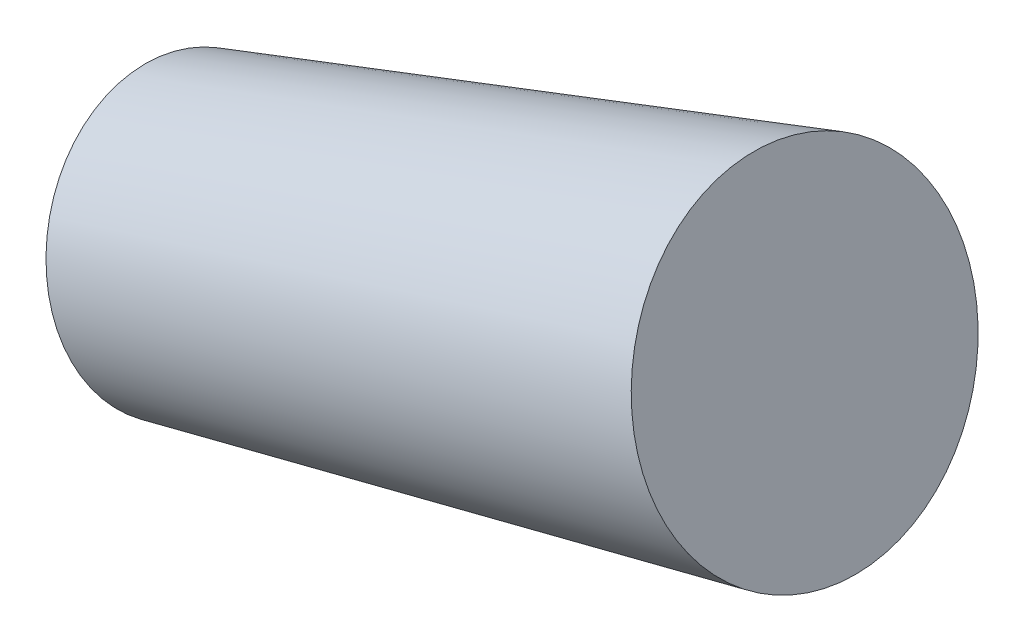
ISO-10303-21;
HEADER;
FILE_DESCRIPTION(('STEP AP214'),'2;1');
FILE_NAME('part.step','',(''),(''),'','','');
FILE_SCHEMA(('AUTOMOTIVE_DESIGN { 1 0 10303 214 1 1 1 1 }'));
ENDSEC;
DATA;
#1=APPLICATION_CONTEXT('core data for automotive mechanical design processes');
#2=APPLICATION_PROTOCOL_DEFINITION('international standard','automotive_design',2000,#1);
#3=PRODUCT_CONTEXT('',#1,'mechanical');
#4=PRODUCT('Part','Part','',(#3));
#5=PRODUCT_RELATED_PRODUCT_CATEGORY('part','',(#4));
#6=PRODUCT_DEFINITION_FORMATION('','',#4);
#7=PRODUCT_DEFINITION_CONTEXT('part definition',#1,'design');
#8=PRODUCT_DEFINITION('design','',#6,#7);
#9=PRODUCT_DEFINITION_SHAPE('','',#8);
#10=(LENGTH_UNIT() NAMED_UNIT(*) SI_UNIT(.MILLI.,.METRE.));
#11=(NAMED_UNIT(*) PLANE_ANGLE_UNIT() SI_UNIT($,.RADIAN.));
#12=(NAMED_UNIT(*) SI_UNIT($,.STERADIAN.) SOLID_ANGLE_UNIT());
#13=UNCERTAINTY_MEASURE_WITH_UNIT(LENGTH_MEASURE(1.E-05),#10,'distance_accuracy_value','');
#14=(GEOMETRIC_REPRESENTATION_CONTEXT(3) GLOBAL_UNCERTAINTY_ASSIGNED_CONTEXT((#13)) GLOBAL_UNIT_ASSIGNED_CONTEXT((#10,
#11,#12)) REPRESENTATION_CONTEXT('',''));
#15=CARTESIAN_POINT('',(0.,0.,0.));
#16=DIRECTION('',(0.,0.,1.));
#17=DIRECTION('',(1.,0.,0.));
#18=AXIS2_PLACEMENT_3D('',#15,#16,#17);
#19=CARTESIAN_POINT('',(14.4972221523261,27.105880525454,-3.69515165011952));
#20=DIRECTION('',(0.952217387187941,0.305421098709586,0.));
#21=DIRECTION('',(0.,0.,1.));
#22=AXIS2_PLACEMENT_3D('',#19,#20,#21);
#23=PLANE('',#22);
#24=CARTESIAN_POINT('',(15.625799515855,23.587292605761,0.));
#25=DIRECTION('',(0.952217387187941,0.305421098709586,0.));
#26=DIRECTION('',(0.305421098709586,-0.952217387187941,0.));
#27=AXIS2_PLACEMENT_3D('',#24,#25,#26);
#28=CIRCLE('',#27,3.69515165011949);
#29=CARTESIAN_POINT('',(16.754376792733,20.068704956221,0.));
#30=VERTEX_POINT('',#29);
#31=EDGE_CURVE('E22',#30,#30,#28,.F.);
#32=ORIENTED_EDGE('',*,*,#31,.F.);
#33=EDGE_LOOP('',(#32));
#34=FACE_BOUND('',#33,.T.);
#35=ADVANCED_FACE('F15',(#34),#23,.T.);
#36=CARTESIAN_POINT('',(2.76839781911444,16.321173184881,-2.9920033525434));
#37=DIRECTION('',(-0.952217387187941,-0.305421098709586,0.));
#38=DIRECTION('',(0.,0.,1.));
#39=AXIS2_PLACEMENT_3D('',#36,#37,#38);
#40=PLANE('',#39);
#41=CARTESIAN_POINT('',(1.85457682366374,19.17021093742,0.));
#42=DIRECTION('',(-0.952217387187941,-0.305421098709586,0.));
#43=DIRECTION('',(-0.305421098709583,0.952217387187932,-1.41721921623646E-07));
#44=AXIS2_PLACEMENT_3D('',#41,#42,#43);
#45=CIRCLE('',#44,2.99200349717684);
#46=CARTESIAN_POINT('',(0.940755828213076,22.0192486899589,-4.24032485124572E-07));
#47=VERTEX_POINT('',#46);
#48=EDGE_CURVE('E10',#47,#47,#45,.T.);
#49=ORIENTED_EDGE('',*,*,#48,.T.);
#50=EDGE_LOOP('',(#49));
#51=FACE_BOUND('',#50,.T.);
#52=ADVANCED_FACE('F30',(#51),#40,.T.);
#53=CARTESIAN_POINT('',(15.625799515855,23.587292605761,0.));
#54=DIRECTION('',(0.952217387187941,0.305421098709586,0.));
#55=DIRECTION('',(0.305421098709586,-0.952217387187941,0.));
#56=AXIS2_PLACEMENT_3D('',#53,#54,#55);
#57=CONICAL_SURFACE('',#56,3.69515165011949,0.0485812397292549);
#58=ORIENTED_EDGE('',*,*,#48,.F.);
#59=EDGE_LOOP('',(#58));
#60=FACE_BOUND('',#59,.T.);
#61=ORIENTED_EDGE('',*,*,#31,.T.);
#62=EDGE_LOOP('',(#61));
#63=FACE_BOUND('',#62,.T.);
#64=ADVANCED_FACE('F17',(#60,#63),#57,.T.);
#65=CLOSED_SHELL('',(#35,#52,#64));
#66=MANIFOLD_SOLID_BREP('B1',#65);
#67=ADVANCED_BREP_SHAPE_REPRESENTATION('',(#18,#66),#14);
#68=SHAPE_DEFINITION_REPRESENTATION(#9,#67);
ENDSEC;
END-ISO-10303-21;
